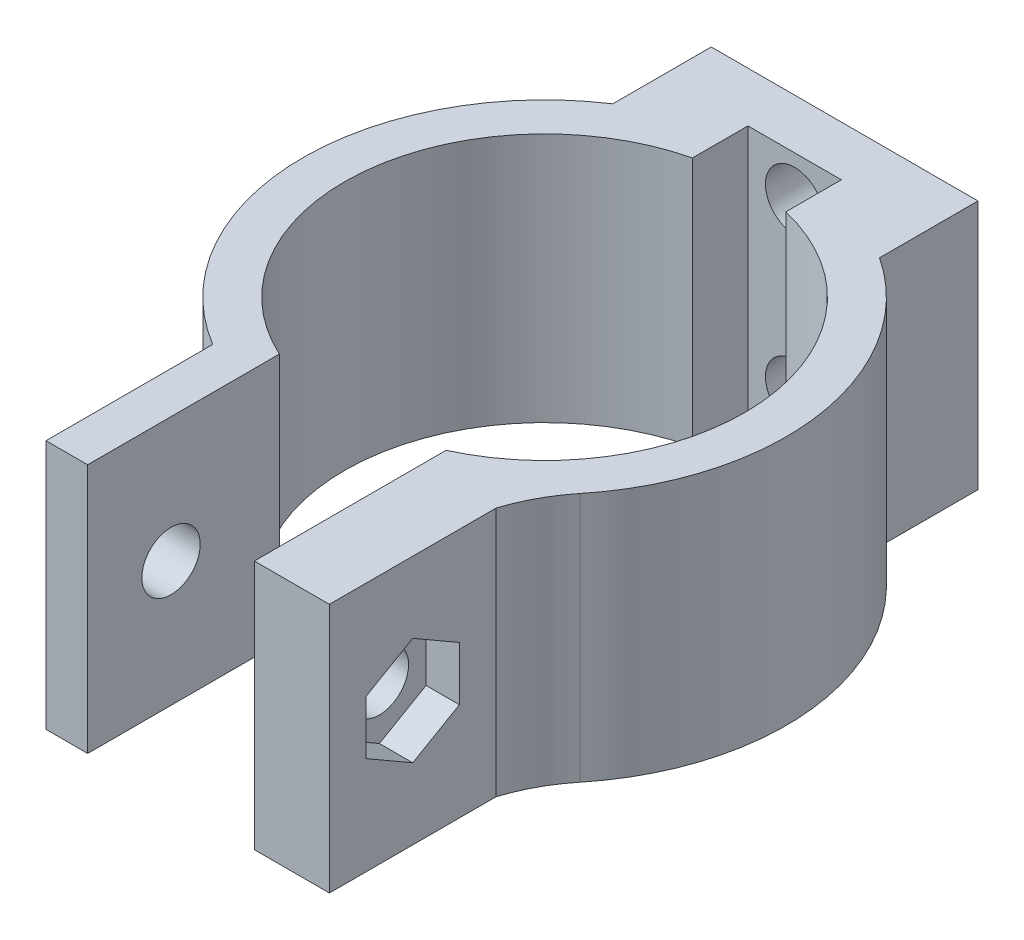
ISO-10303-21;
HEADER;
FILE_DESCRIPTION(('STEP AP214'),'2;1');
FILE_NAME('part.step','',(''),(''),'','','');
FILE_SCHEMA(('AUTOMOTIVE_DESIGN { 1 0 10303 214 1 1 1 1 }'));
ENDSEC;
DATA;
#1=APPLICATION_CONTEXT('core data for automotive mechanical design processes');
#2=APPLICATION_PROTOCOL_DEFINITION('international standard','automotive_design',2000,#1);
#3=PRODUCT_CONTEXT('',#1,'mechanical');
#4=PRODUCT('Part','Part','',(#3));
#5=PRODUCT_RELATED_PRODUCT_CATEGORY('part','',(#4));
#6=PRODUCT_DEFINITION_FORMATION('','',#4);
#7=PRODUCT_DEFINITION_CONTEXT('part definition',#1,'design');
#8=PRODUCT_DEFINITION('design','',#6,#7);
#9=PRODUCT_DEFINITION_SHAPE('','',#8);
#10=(LENGTH_UNIT() NAMED_UNIT(*) SI_UNIT(.MILLI.,.METRE.));
#11=(NAMED_UNIT(*) PLANE_ANGLE_UNIT() SI_UNIT($,.RADIAN.));
#12=(NAMED_UNIT(*) SI_UNIT($,.STERADIAN.) SOLID_ANGLE_UNIT());
#13=UNCERTAINTY_MEASURE_WITH_UNIT(LENGTH_MEASURE(1.E-05),#10,'distance_accuracy_value','');
#14=(GEOMETRIC_REPRESENTATION_CONTEXT(3) GLOBAL_UNCERTAINTY_ASSIGNED_CONTEXT((#13)) GLOBAL_UNIT_ASSIGNED_CONTEXT((#10,
#11,#12)) REPRESENTATION_CONTEXT('',''));
#15=CARTESIAN_POINT('',(0.,0.,0.));
#16=DIRECTION('',(0.,0.,1.));
#17=DIRECTION('',(1.,0.,0.));
#18=AXIS2_PLACEMENT_3D('',#15,#16,#17);
#19=CARTESIAN_POINT('',(0.,15.,-15.));
#20=DIRECTION('',(0.,0.,-1.));
#21=DIRECTION('',(-1.,0.,0.));
#22=AXIS2_PLACEMENT_3D('',#19,#20,#21);
#23=PLANE('',#22);
#24=CARTESIAN_POINT('',(0.,12.5,-15.));
#25=DIRECTION('',(0.,0.,-1.));
#26=DIRECTION('',(-1.,0.,0.));
#27=AXIS2_PLACEMENT_3D('',#24,#25,#26);
#28=CIRCLE('',#27,1.75);
#29=CARTESIAN_POINT('',(-1.75,12.5,-15.));
#30=VERTEX_POINT('',#29);
#31=EDGE_CURVE('E269',#30,#30,#28,.T.);
#32=ORIENTED_EDGE('',*,*,#31,.T.);
#33=EDGE_LOOP('',(#32));
#34=FACE_BOUND('',#33,.T.);
#35=CARTESIAN_POINT('',(0.,2.5,-15.));
#36=DIRECTION('',(0.,0.,-1.));
#37=DIRECTION('',(-1.,0.,0.));
#38=AXIS2_PLACEMENT_3D('',#35,#36,#37);
#39=CIRCLE('',#38,1.75);
#40=CARTESIAN_POINT('',(-1.75,2.5,-15.));
#41=VERTEX_POINT('',#40);
#42=EDGE_CURVE('E265',#41,#41,#39,.T.);
#43=ORIENTED_EDGE('',*,*,#42,.T.);
#44=EDGE_LOOP('',(#43));
#45=FACE_BOUND('',#44,.T.);
#46=DIRECTION('',(1.,0.,0.));
#47=VECTOR('',#46,1.);
#48=CARTESIAN_POINT('',(0.,0.,-15.));
#49=LINE('',#48,#47);
#50=CARTESIAN_POINT('',(-2.8,0.,-15.));
#51=VERTEX_POINT('',#50);
#52=CARTESIAN_POINT('',(2.8,0.,-15.));
#53=VERTEX_POINT('',#52);
#54=EDGE_CURVE('E272',#51,#53,#49,.T.);
#55=ORIENTED_EDGE('',*,*,#54,.T.);
#56=DIRECTION('',(0.,-1.,0.));
#57=VECTOR('',#56,1.);
#58=CARTESIAN_POINT('',(2.8,15.,-15.));
#59=LINE('',#58,#57);
#60=CARTESIAN_POINT('',(2.8,15.,-15.));
#61=VERTEX_POINT('',#60);
#62=EDGE_CURVE('E380',#61,#53,#59,.T.);
#63=ORIENTED_EDGE('',*,*,#62,.F.);
#64=DIRECTION('',(1.,0.,0.));
#65=VECTOR('',#64,1.);
#66=CARTESIAN_POINT('',(0.,15.,-15.));
#67=LINE('',#66,#65);
#68=CARTESIAN_POINT('',(-2.8,15.,-15.));
#69=VERTEX_POINT('',#68);
#70=EDGE_CURVE('E273',#69,#61,#67,.T.);
#71=ORIENTED_EDGE('',*,*,#70,.F.);
#72=DIRECTION('',(0.,-1.,0.));
#73=VECTOR('',#72,1.);
#74=CARTESIAN_POINT('',(-2.8,15.,-15.));
#75=LINE('',#74,#73);
#76=EDGE_CURVE('E312',#69,#51,#75,.T.);
#77=ORIENTED_EDGE('',*,*,#76,.T.);
#78=EDGE_LOOP('',(#55,#63,#71,#77));
#79=FACE_BOUND('',#78,.T.);
#80=ADVANCED_FACE('F32',(#34,#45,#79),#23,.F.);
#81=CARTESIAN_POINT('',(2.8,15.,0.));
#82=DIRECTION('',(-1.,0.,0.));
#83=DIRECTION('',(0.,0.,1.));
#84=AXIS2_PLACEMENT_3D('',#81,#82,#83);
#85=PLANE('',#84);
#86=DIRECTION('',(0.,0.,-1.));
#87=VECTOR('',#86,1.);
#88=CARTESIAN_POINT('',(2.8,0.,0.));
#89=LINE('',#88,#87);
#90=CARTESIAN_POINT('',(2.8,0.,-11.6687617166519));
#91=VERTEX_POINT('',#90);
#92=EDGE_CURVE('E315',#91,#53,#89,.T.);
#93=ORIENTED_EDGE('',*,*,#92,.F.);
#94=DIRECTION('',(0.,-1.,0.));
#95=VECTOR('',#94,1.);
#96=CARTESIAN_POINT('',(2.8,15.,-11.6687617166519));
#97=LINE('',#96,#95);
#98=CARTESIAN_POINT('',(2.8,15.,-11.6687617166519));
#99=VERTEX_POINT('',#98);
#100=EDGE_CURVE('E378',#99,#91,#97,.T.);
#101=ORIENTED_EDGE('',*,*,#100,.F.);
#102=DIRECTION('',(0.,0.,-1.));
#103=VECTOR('',#102,1.);
#104=CARTESIAN_POINT('',(2.8,15.,0.));
#105=LINE('',#104,#103);
#106=EDGE_CURVE('E275',#99,#61,#105,.T.);
#107=ORIENTED_EDGE('',*,*,#106,.T.);
#108=ORIENTED_EDGE('',*,*,#62,.T.);
#109=EDGE_LOOP('',(#93,#101,#107,#108));
#110=FACE_BOUND('',#109,.T.);
#111=ADVANCED_FACE('F447',(#110),#85,.T.);
#112=CARTESIAN_POINT('',(0.,15.,0.));
#113=DIRECTION('',(0.,-1.,0.));
#114=DIRECTION('',(0.,0.,-1.));
#115=AXIS2_PLACEMENT_3D('',#112,#113,#114);
#116=CYLINDRICAL_SURFACE('',#115,12.);
#117=CARTESIAN_POINT('',(0.,0.,0.));
#118=DIRECTION('',(0.,1.,0.));
#119=DIRECTION('',(0.,0.,1.));
#120=AXIS2_PLACEMENT_3D('',#117,#118,#119);
#121=CIRCLE('',#120,12.);
#122=CARTESIAN_POINT('',(5.,0.,10.9087121146357));
#123=VERTEX_POINT('',#122);
#124=EDGE_CURVE('E318',#123,#91,#121,.T.);
#125=ORIENTED_EDGE('',*,*,#124,.F.);
#126=DIRECTION('',(0.,-1.,0.));
#127=VECTOR('',#126,1.);
#128=CARTESIAN_POINT('',(5.,15.,10.9087121146357));
#129=LINE('',#128,#127);
#130=CARTESIAN_POINT('',(5.,15.,10.9087121146357));
#131=VERTEX_POINT('',#130);
#132=EDGE_CURVE('E376',#131,#123,#129,.T.);
#133=ORIENTED_EDGE('',*,*,#132,.F.);
#134=CARTESIAN_POINT('',(0.,15.,0.));
#135=DIRECTION('',(0.,1.,0.));
#136=DIRECTION('',(0.,0.,1.));
#137=AXIS2_PLACEMENT_3D('',#134,#135,#136);
#138=CIRCLE('',#137,12.);
#139=EDGE_CURVE('E279',#131,#99,#138,.T.);
#140=ORIENTED_EDGE('',*,*,#139,.T.);
#141=ORIENTED_EDGE('',*,*,#100,.T.);
#142=EDGE_LOOP('',(#125,#133,#140,#141));
#143=FACE_BOUND('',#142,.T.);
#144=ADVANCED_FACE('F450',(#143),#116,.F.);
#145=CARTESIAN_POINT('',(5.,15.,0.));
#146=DIRECTION('',(1.,0.,0.));
#147=DIRECTION('',(0.,0.,-1.));
#148=AXIS2_PLACEMENT_3D('',#145,#146,#147);
#149=PLANE('',#148);
#150=CARTESIAN_POINT('',(5.00000000000001,7.5,17.4096736459909));
#151=DIRECTION('',(1.,0.,0.));
#152=DIRECTION('',(0.,0.,-1.));
#153=AXIS2_PLACEMENT_3D('',#150,#151,#152);
#154=CIRCLE('',#153,1.75);
#155=CARTESIAN_POINT('',(5.00000000000001,7.5,15.6596736459909));
#156=VERTEX_POINT('',#155);
#157=EDGE_CURVE('E261',#156,#156,#154,.T.);
#158=ORIENTED_EDGE('',*,*,#157,.T.);
#159=EDGE_LOOP('',(#158));
#160=FACE_BOUND('',#159,.T.);
#161=DIRECTION('',(0.,0.,1.));
#162=VECTOR('',#161,1.);
#163=CARTESIAN_POINT('',(5.,0.,0.));
#164=LINE('',#163,#162);
#165=CARTESIAN_POINT('',(5.00000000000001,0.,22.4096736459909));
#166=VERTEX_POINT('',#165);
#167=EDGE_CURVE('E321',#123,#166,#164,.T.);
#168=ORIENTED_EDGE('',*,*,#167,.T.);
#169=DIRECTION('',(0.,-1.,0.));
#170=VECTOR('',#169,1.);
#171=CARTESIAN_POINT('',(5.00000000000001,15.,22.4096736459909));
#172=LINE('',#171,#170);
#173=CARTESIAN_POINT('',(5.00000000000001,15.,22.4096736459909));
#174=VERTEX_POINT('',#173);
#175=EDGE_CURVE('E373',#174,#166,#172,.T.);
#176=ORIENTED_EDGE('',*,*,#175,.F.);
#177=DIRECTION('',(0.,0.,1.));
#178=VECTOR('',#177,1.);
#179=CARTESIAN_POINT('',(5.,15.,0.));
#180=LINE('',#179,#178);
#181=EDGE_CURVE('E282',#131,#174,#180,.T.);
#182=ORIENTED_EDGE('',*,*,#181,.F.);
#183=ORIENTED_EDGE('',*,*,#132,.T.);
#184=EDGE_LOOP('',(#168,#176,#182,#183));
#185=FACE_BOUND('',#184,.T.);
#186=ADVANCED_FACE('F455',(#160,#185),#149,.F.);
#187=CARTESIAN_POINT('',(0.,15.,22.4096736459909));
#188=DIRECTION('',(0.,0.,-1.));
#189=DIRECTION('',(-1.,0.,0.));
#190=AXIS2_PLACEMENT_3D('',#187,#188,#189);
#191=PLANE('',#190);
#192=DIRECTION('',(1.,0.,0.));
#193=VECTOR('',#192,1.);
#194=CARTESIAN_POINT('',(0.,0.,22.4096736459909));
#195=LINE('',#194,#193);
#196=CARTESIAN_POINT('',(9.50000000000001,0.,22.4096736459909));
#197=VERTEX_POINT('',#196);
#198=EDGE_CURVE('E323',#166,#197,#195,.T.);
#199=ORIENTED_EDGE('',*,*,#198,.T.);
#200=DIRECTION('',(0.,-1.,0.));
#201=VECTOR('',#200,1.);
#202=CARTESIAN_POINT('',(9.50000000000001,15.,22.4096736459909));
#203=LINE('',#202,#201);
#204=CARTESIAN_POINT('',(9.50000000000001,15.,22.4096736459909));
#205=VERTEX_POINT('',#204);
#206=EDGE_CURVE('E205',#205,#197,#203,.T.);
#207=ORIENTED_EDGE('',*,*,#206,.F.);
#208=DIRECTION('',(1.,0.,0.));
#209=VECTOR('',#208,1.);
#210=CARTESIAN_POINT('',(0.,15.,22.4096736459909));
#211=LINE('',#210,#209);
#212=EDGE_CURVE('E284',#174,#205,#211,.T.);
#213=ORIENTED_EDGE('',*,*,#212,.F.);
#214=ORIENTED_EDGE('',*,*,#175,.T.);
#215=EDGE_LOOP('',(#199,#207,#213,#214));
#216=FACE_BOUND('',#215,.T.);
#217=ADVANCED_FACE('F458',(#216),#191,.F.);
#218=CARTESIAN_POINT('',(7.50000000000001,15.,0.));
#219=DIRECTION('',(-1.,0.,0.));
#220=DIRECTION('',(0.,0.,1.));
#221=AXIS2_PLACEMENT_3D('',#218,#219,#220);
#222=PLANE('',#221);
#223=DIRECTION('',(0.,1.,0.));
#224=VECTOR('',#223,1.);
#225=CARTESIAN_POINT('',(7.50000000000001,5.88341924626905,14.6096736459909));
#226=LINE('',#225,#224);
#227=CARTESIAN_POINT('',(7.50000000000001,5.88341924626905,14.6096736459909));
#228=VERTEX_POINT('',#227);
#229=CARTESIAN_POINT('',(7.50000000000001,9.11658075373096,14.6096736459909));
#230=VERTEX_POINT('',#229);
#231=EDGE_CURVE('E198',#228,#230,#226,.T.);
#232=ORIENTED_EDGE('',*,*,#231,.T.);
#233=DIRECTION('',(0.,0.5,0.866025403784439));
#234=VECTOR('',#233,1.);
#235=CARTESIAN_POINT('',(7.50000000000001,9.11658075373096,14.6096736459909));
#236=LINE('',#235,#234);
#237=CARTESIAN_POINT('',(7.50000000000001,10.7331615074619,17.4096736459909));
#238=VERTEX_POINT('',#237);
#239=EDGE_CURVE('E222',#230,#238,#236,.T.);
#240=ORIENTED_EDGE('',*,*,#239,.T.);
#241=DIRECTION('',(0.,-0.5,0.866025403784438));
#242=VECTOR('',#241,1.);
#243=CARTESIAN_POINT('',(7.50000000000001,10.7331615074619,17.4096736459909));
#244=LINE('',#243,#242);
#245=CARTESIAN_POINT('',(7.50000000000001,9.11658075373096,20.2096736459909));
#246=VERTEX_POINT('',#245);
#247=EDGE_CURVE('E204',#238,#246,#244,.T.);
#248=ORIENTED_EDGE('',*,*,#247,.T.);
#249=DIRECTION('',(0.,-1.,0.));
#250=VECTOR('',#249,1.);
#251=CARTESIAN_POINT('',(7.50000000000001,9.11658075373096,20.2096736459909));
#252=LINE('',#251,#250);
#253=CARTESIAN_POINT('',(7.50000000000001,5.88341924626906,20.2096736459909));
#254=VERTEX_POINT('',#253);
#255=EDGE_CURVE('E225',#246,#254,#252,.T.);
#256=ORIENTED_EDGE('',*,*,#255,.T.);
#257=DIRECTION('',(0.,-0.5,-0.866025403784439));
#258=VECTOR('',#257,1.);
#259=CARTESIAN_POINT('',(7.50000000000001,5.88341924626906,20.2096736459909));
#260=LINE('',#259,#258);
#261=CARTESIAN_POINT('',(7.50000000000001,4.26683849253811,17.4096736459909));
#262=VERTEX_POINT('',#261);
#263=EDGE_CURVE('E228',#254,#262,#260,.T.);
#264=ORIENTED_EDGE('',*,*,#263,.T.);
#265=DIRECTION('',(0.,0.5,-0.866025403784439));
#266=VECTOR('',#265,1.);
#267=CARTESIAN_POINT('',(7.50000000000001,4.26683849253811,17.4096736459909));
#268=LINE('',#267,#266);
#269=EDGE_CURVE('E231',#262,#228,#268,.T.);
#270=ORIENTED_EDGE('',*,*,#269,.T.);
#271=EDGE_LOOP('',(#232,#240,#248,#256,#264,#270));
#272=FACE_BOUND('',#271,.T.);
#273=CARTESIAN_POINT('',(7.50000000000001,7.5,17.4096736459909));
#274=DIRECTION('',(1.,0.,0.));
#275=DIRECTION('',(0.,0.,-1.));
#276=AXIS2_PLACEMENT_3D('',#273,#274,#275);
#277=CIRCLE('',#276,1.75);
#278=CARTESIAN_POINT('',(7.50000000000001,7.5,15.6596736459909));
#279=VERTEX_POINT('',#278);
#280=EDGE_CURVE('E254',#279,#279,#277,.T.);
#281=ORIENTED_EDGE('',*,*,#280,.F.);
#282=EDGE_LOOP('',(#281));
#283=FACE_BOUND('',#282,.T.);
#284=ADVANCED_FACE('F460',(#272,#283),#222,.F.);
#285=CARTESIAN_POINT('',(0.,15.,0.));
#286=DIRECTION('',(0.,-1.,0.));
#287=DIRECTION('',(0.,0.,-1.));
#288=AXIS2_PLACEMENT_3D('',#285,#286,#287);
#289=CYLINDRICAL_SURFACE('',#288,14.5);
#290=CARTESIAN_POINT('',(0.,15.,0.));
#291=DIRECTION('',(0.,1.,0.));
#292=DIRECTION('',(0.,0.,1.));
#293=AXIS2_PLACEMENT_3D('',#290,#291,#292);
#294=CIRCLE('',#293,14.5);
#295=CARTESIAN_POINT('',(11.2653016759038,15.,9.12923754488181));
#296=VERTEX_POINT('',#295);
#297=CARTESIAN_POINT('',(8.,15.,-12.0933866224478));
#298=VERTEX_POINT('',#297);
#299=EDGE_CURVE('E286',#296,#298,#294,.T.);
#300=ORIENTED_EDGE('',*,*,#299,.F.);
#301=DIRECTION('',(0.,-1.,0.));
#302=VECTOR('',#301,1.);
#303=CARTESIAN_POINT('',(11.2653016759038,15.,9.12923754488181));
#304=LINE('',#303,#302);
#305=CARTESIAN_POINT('',(11.2653016759038,0.,9.12923754488181));
#306=VERTEX_POINT('',#305);
#307=EDGE_CURVE('E382',#296,#306,#304,.T.);
#308=ORIENTED_EDGE('',*,*,#307,.T.);
#309=CARTESIAN_POINT('',(0.,0.,0.));
#310=DIRECTION('',(0.,1.,0.));
#311=DIRECTION('',(0.,0.,1.));
#312=AXIS2_PLACEMENT_3D('',#309,#310,#311);
#313=CIRCLE('',#312,14.5);
#314=CARTESIAN_POINT('',(8.,0.,-12.0933866224478));
#315=VERTEX_POINT('',#314);
#316=EDGE_CURVE('E325',#306,#315,#313,.T.);
#317=ORIENTED_EDGE('',*,*,#316,.T.);
#318=DIRECTION('',(0.,-1.,0.));
#319=VECTOR('',#318,1.);
#320=CARTESIAN_POINT('',(8.,15.,-12.0933866224478));
#321=LINE('',#320,#319);
#322=EDGE_CURVE('E370',#298,#315,#321,.T.);
#323=ORIENTED_EDGE('',*,*,#322,.F.);
#324=EDGE_LOOP('',(#300,#308,#317,#323));
#325=FACE_BOUND('',#324,.T.);
#326=ADVANCED_FACE('F399',(#325),#289,.T.);
#327=CARTESIAN_POINT('',(8.00000000000001,15.,0.));
#328=DIRECTION('',(-1.,0.,0.));
#329=DIRECTION('',(0.,0.,1.));
#330=AXIS2_PLACEMENT_3D('',#327,#328,#329);
#331=PLANE('',#330);
#332=DIRECTION('',(0.,0.,-1.));
#333=VECTOR('',#332,1.);
#334=CARTESIAN_POINT('',(8.00000000000001,0.,0.));
#335=LINE('',#334,#333);
#336=CARTESIAN_POINT('',(8.,0.,-18.));
#337=VERTEX_POINT('',#336);
#338=EDGE_CURVE('E327',#315,#337,#335,.T.);
#339=ORIENTED_EDGE('',*,*,#338,.T.);
#340=DIRECTION('',(0.,-1.,0.));
#341=VECTOR('',#340,1.);
#342=CARTESIAN_POINT('',(8.,15.,-18.));
#343=LINE('',#342,#341);
#344=CARTESIAN_POINT('',(8.,15.,-18.));
#345=VERTEX_POINT('',#344);
#346=EDGE_CURVE('E367',#345,#337,#343,.T.);
#347=ORIENTED_EDGE('',*,*,#346,.F.);
#348=DIRECTION('',(0.,0.,-1.));
#349=VECTOR('',#348,1.);
#350=CARTESIAN_POINT('',(8.00000000000001,15.,0.));
#351=LINE('',#350,#349);
#352=EDGE_CURVE('E288',#298,#345,#351,.T.);
#353=ORIENTED_EDGE('',*,*,#352,.F.);
#354=ORIENTED_EDGE('',*,*,#322,.T.);
#355=EDGE_LOOP('',(#339,#347,#353,#354));
#356=FACE_BOUND('',#355,.T.);
#357=ADVANCED_FACE('F408',(#356),#331,.F.);
#358=CARTESIAN_POINT('',(0.,15.,-18.));
#359=DIRECTION('',(0.,0.,1.));
#360=DIRECTION('',(1.,0.,0.));
#361=AXIS2_PLACEMENT_3D('',#358,#359,#360);
#362=PLANE('',#361);
#363=CARTESIAN_POINT('',(0.,12.5,-18.));
#364=DIRECTION('',(0.,0.,1.));
#365=DIRECTION('',(1.,0.,0.));
#366=AXIS2_PLACEMENT_3D('',#363,#364,#365);
#367=CIRCLE('',#366,1.75);
#368=CARTESIAN_POINT('',(1.75,12.5,-18.));
#369=VERTEX_POINT('',#368);
#370=EDGE_CURVE('E268',#369,#369,#367,.T.);
#371=ORIENTED_EDGE('',*,*,#370,.T.);
#372=EDGE_LOOP('',(#371));
#373=FACE_BOUND('',#372,.T.);
#374=CARTESIAN_POINT('',(0.,2.5,-18.));
#375=DIRECTION('',(0.,0.,1.));
#376=DIRECTION('',(1.,0.,0.));
#377=AXIS2_PLACEMENT_3D('',#374,#375,#376);
#378=CIRCLE('',#377,1.75);
#379=CARTESIAN_POINT('',(1.75,2.5,-18.));
#380=VERTEX_POINT('',#379);
#381=EDGE_CURVE('E264',#380,#380,#378,.T.);
#382=ORIENTED_EDGE('',*,*,#381,.T.);
#383=EDGE_LOOP('',(#382));
#384=FACE_BOUND('',#383,.T.);
#385=DIRECTION('',(-1.,0.,0.));
#386=VECTOR('',#385,1.);
#387=CARTESIAN_POINT('',(0.,0.,-18.));
#388=LINE('',#387,#386);
#389=CARTESIAN_POINT('',(-8.,0.,-18.));
#390=VERTEX_POINT('',#389);
#391=EDGE_CURVE('E329',#337,#390,#388,.T.);
#392=ORIENTED_EDGE('',*,*,#391,.T.);
#393=DIRECTION('',(0.,-1.,0.));
#394=VECTOR('',#393,1.);
#395=CARTESIAN_POINT('',(-8.,15.,-18.));
#396=LINE('',#395,#394);
#397=CARTESIAN_POINT('',(-8.,15.,-18.));
#398=VERTEX_POINT('',#397);
#399=EDGE_CURVE('E365',#398,#390,#396,.T.);
#400=ORIENTED_EDGE('',*,*,#399,.F.);
#401=DIRECTION('',(-1.,0.,0.));
#402=VECTOR('',#401,1.);
#403=CARTESIAN_POINT('',(0.,15.,-18.));
#404=LINE('',#403,#402);
#405=EDGE_CURVE('E290',#345,#398,#404,.T.);
#406=ORIENTED_EDGE('',*,*,#405,.F.);
#407=ORIENTED_EDGE('',*,*,#346,.T.);
#408=EDGE_LOOP('',(#392,#400,#406,#407));
#409=FACE_BOUND('',#408,.T.);
#410=ADVANCED_FACE('F411',(#373,#384,#409),#362,.F.);
#411=CARTESIAN_POINT('',(-7.99999999999999,15.,0.));
#412=DIRECTION('',(-1.,0.,0.));
#413=DIRECTION('',(0.,0.,1.));
#414=AXIS2_PLACEMENT_3D('',#411,#412,#413);
#415=PLANE('',#414);
#416=DIRECTION('',(0.,0.,-1.));
#417=VECTOR('',#416,1.);
#418=CARTESIAN_POINT('',(-7.99999999999999,0.,0.));
#419=LINE('',#418,#417);
#420=CARTESIAN_POINT('',(-8.,0.,-12.0933866224478));
#421=VERTEX_POINT('',#420);
#422=EDGE_CURVE('E332',#421,#390,#419,.T.);
#423=ORIENTED_EDGE('',*,*,#422,.F.);
#424=DIRECTION('',(0.,-1.,0.));
#425=VECTOR('',#424,1.);
#426=CARTESIAN_POINT('',(-8.,15.,-12.0933866224478));
#427=LINE('',#426,#425);
#428=CARTESIAN_POINT('',(-8.,15.,-12.0933866224478));
#429=VERTEX_POINT('',#428);
#430=EDGE_CURVE('E363',#429,#421,#427,.T.);
#431=ORIENTED_EDGE('',*,*,#430,.F.);
#432=DIRECTION('',(0.,0.,-1.));
#433=VECTOR('',#432,1.);
#434=CARTESIAN_POINT('',(-7.99999999999999,15.,0.));
#435=LINE('',#434,#433);
#436=EDGE_CURVE('E292',#429,#398,#435,.T.);
#437=ORIENTED_EDGE('',*,*,#436,.T.);
#438=ORIENTED_EDGE('',*,*,#399,.T.);
#439=EDGE_LOOP('',(#423,#431,#437,#438));
#440=FACE_BOUND('',#439,.T.);
#441=ADVANCED_FACE('F414',(#440),#415,.T.);
#442=CARTESIAN_POINT('',(0.,15.,0.));
#443=DIRECTION('',(0.,-1.,0.));
#444=DIRECTION('',(0.,0.,-1.));
#445=AXIS2_PLACEMENT_3D('',#442,#443,#444);
#446=CYLINDRICAL_SURFACE('',#445,14.5);
#447=CARTESIAN_POINT('',(0.,0.,0.));
#448=DIRECTION('',(0.,1.,0.));
#449=DIRECTION('',(0.,0.,1.));
#450=AXIS2_PLACEMENT_3D('',#447,#448,#449);
#451=CIRCLE('',#450,14.5);
#452=CARTESIAN_POINT('',(-7.5,0.,12.4096736459909));
#453=VERTEX_POINT('',#452);
#454=EDGE_CURVE('E335',#453,#421,#451,.F.);
#455=ORIENTED_EDGE('',*,*,#454,.F.);
#456=DIRECTION('',(0.,-1.,0.));
#457=VECTOR('',#456,1.);
#458=CARTESIAN_POINT('',(-7.5,15.,12.4096736459909));
#459=LINE('',#458,#457);
#460=CARTESIAN_POINT('',(-7.5,15.,12.4096736459909));
#461=VERTEX_POINT('',#460);
#462=EDGE_CURVE('E361',#461,#453,#459,.T.);
#463=ORIENTED_EDGE('',*,*,#462,.F.);
#464=CARTESIAN_POINT('',(0.,15.,0.));
#465=DIRECTION('',(0.,1.,0.));
#466=DIRECTION('',(0.,0.,1.));
#467=AXIS2_PLACEMENT_3D('',#464,#465,#466);
#468=CIRCLE('',#467,14.5);
#469=EDGE_CURVE('E295',#461,#429,#468,.F.);
#470=ORIENTED_EDGE('',*,*,#469,.T.);
#471=ORIENTED_EDGE('',*,*,#430,.T.);
#472=EDGE_LOOP('',(#455,#463,#470,#471));
#473=FACE_BOUND('',#472,.T.);
#474=ADVANCED_FACE('F419',(#473),#446,.T.);
#475=CARTESIAN_POINT('',(-7.5,15.,0.));
#476=DIRECTION('',(-1.,0.,0.));
#477=DIRECTION('',(0.,0.,1.));
#478=AXIS2_PLACEMENT_3D('',#475,#476,#477);
#479=PLANE('',#478);
#480=CARTESIAN_POINT('',(-7.5,7.5,17.4096736459909));
#481=DIRECTION('',(-1.,0.,0.));
#482=DIRECTION('',(0.,0.,1.));
#483=AXIS2_PLACEMENT_3D('',#480,#481,#482);
#484=CIRCLE('',#483,1.75);
#485=CARTESIAN_POINT('',(-7.5,7.5,19.1596736459909));
#486=VERTEX_POINT('',#485);
#487=EDGE_CURVE('E258',#486,#486,#484,.T.);
#488=ORIENTED_EDGE('',*,*,#487,.F.);
#489=EDGE_LOOP('',(#488));
#490=FACE_BOUND('',#489,.T.);
#491=DIRECTION('',(0.,0.,-1.));
#492=VECTOR('',#491,1.);
#493=CARTESIAN_POINT('',(-7.5,0.,0.));
#494=LINE('',#493,#492);
#495=CARTESIAN_POINT('',(-7.5,0.,22.4096736459909));
#496=VERTEX_POINT('',#495);
#497=EDGE_CURVE('E338',#496,#453,#494,.T.);
#498=ORIENTED_EDGE('',*,*,#497,.F.);
#499=DIRECTION('',(0.,-1.,0.));
#500=VECTOR('',#499,1.);
#501=CARTESIAN_POINT('',(-7.5,15.,22.4096736459909));
#502=LINE('',#501,#500);
#503=CARTESIAN_POINT('',(-7.5,15.,22.4096736459909));
#504=VERTEX_POINT('',#503);
#505=EDGE_CURVE('E359',#504,#496,#502,.T.);
#506=ORIENTED_EDGE('',*,*,#505,.F.);
#507=DIRECTION('',(0.,0.,-1.));
#508=VECTOR('',#507,1.);
#509=CARTESIAN_POINT('',(-7.5,15.,0.));
#510=LINE('',#509,#508);
#511=EDGE_CURVE('E298',#504,#461,#510,.T.);
#512=ORIENTED_EDGE('',*,*,#511,.T.);
#513=ORIENTED_EDGE('',*,*,#462,.T.);
#514=EDGE_LOOP('',(#498,#506,#512,#513));
#515=FACE_BOUND('',#514,.T.);
#516=ADVANCED_FACE('F422',(#490,#515),#479,.T.);
#517=CARTESIAN_POINT('',(0.,15.,22.4096736459909));
#518=DIRECTION('',(0.,0.,1.));
#519=DIRECTION('',(1.,0.,0.));
#520=AXIS2_PLACEMENT_3D('',#517,#518,#519);
#521=PLANE('',#520);
#522=DIRECTION('',(-1.,0.,0.));
#523=VECTOR('',#522,1.);
#524=CARTESIAN_POINT('',(0.,0.,22.4096736459909));
#525=LINE('',#524,#523);
#526=CARTESIAN_POINT('',(-5.,0.,22.4096736459909));
#527=VERTEX_POINT('',#526);
#528=EDGE_CURVE('E341',#527,#496,#525,.T.);
#529=ORIENTED_EDGE('',*,*,#528,.F.);
#530=DIRECTION('',(0.,-1.,0.));
#531=VECTOR('',#530,1.);
#532=CARTESIAN_POINT('',(-5.,15.,22.4096736459909));
#533=LINE('',#532,#531);
#534=CARTESIAN_POINT('',(-5.,15.,22.4096736459909));
#535=VERTEX_POINT('',#534);
#536=EDGE_CURVE('E357',#535,#527,#533,.T.);
#537=ORIENTED_EDGE('',*,*,#536,.F.);
#538=DIRECTION('',(-1.,0.,0.));
#539=VECTOR('',#538,1.);
#540=CARTESIAN_POINT('',(0.,15.,22.4096736459909));
#541=LINE('',#540,#539);
#542=EDGE_CURVE('E301',#535,#504,#541,.T.);
#543=ORIENTED_EDGE('',*,*,#542,.T.);
#544=ORIENTED_EDGE('',*,*,#505,.T.);
#545=EDGE_LOOP('',(#529,#537,#543,#544));
#546=FACE_BOUND('',#545,.T.);
#547=ADVANCED_FACE('F427',(#546),#521,.T.);
#548=CARTESIAN_POINT('',(-5.,15.,0.));
#549=DIRECTION('',(1.,0.,0.));
#550=DIRECTION('',(0.,0.,-1.));
#551=AXIS2_PLACEMENT_3D('',#548,#549,#550);
#552=PLANE('',#551);
#553=CARTESIAN_POINT('',(-5.,7.5,17.4096736459909));
#554=DIRECTION('',(1.,0.,0.));
#555=DIRECTION('',(0.,0.,-1.));
#556=AXIS2_PLACEMENT_3D('',#553,#554,#555);
#557=CIRCLE('',#556,1.75);
#558=CARTESIAN_POINT('',(-5.,7.5,15.6596736459909));
#559=VERTEX_POINT('',#558);
#560=EDGE_CURVE('E257',#559,#559,#557,.T.);
#561=ORIENTED_EDGE('',*,*,#560,.F.);
#562=EDGE_LOOP('',(#561));
#563=FACE_BOUND('',#562,.T.);
#564=DIRECTION('',(0.,0.,1.));
#565=VECTOR('',#564,1.);
#566=CARTESIAN_POINT('',(-5.,0.,0.));
#567=LINE('',#566,#565);
#568=CARTESIAN_POINT('',(-5.,0.,10.9087121146357));
#569=VERTEX_POINT('',#568);
#570=EDGE_CURVE('E344',#569,#527,#567,.T.);
#571=ORIENTED_EDGE('',*,*,#570,.F.);
#572=DIRECTION('',(0.,-1.,0.));
#573=VECTOR('',#572,1.);
#574=CARTESIAN_POINT('',(-5.,15.,10.9087121146357));
#575=LINE('',#574,#573);
#576=CARTESIAN_POINT('',(-5.,15.,10.9087121146357));
#577=VERTEX_POINT('',#576);
#578=EDGE_CURVE('E355',#577,#569,#575,.T.);
#579=ORIENTED_EDGE('',*,*,#578,.F.);
#580=DIRECTION('',(0.,0.,1.));
#581=VECTOR('',#580,1.);
#582=CARTESIAN_POINT('',(-5.,15.,0.));
#583=LINE('',#582,#581);
#584=EDGE_CURVE('E304',#577,#535,#583,.T.);
#585=ORIENTED_EDGE('',*,*,#584,.T.);
#586=ORIENTED_EDGE('',*,*,#536,.T.);
#587=EDGE_LOOP('',(#571,#579,#585,#586));
#588=FACE_BOUND('',#587,.T.);
#589=ADVANCED_FACE('F430',(#563,#588),#552,.T.);
#590=CARTESIAN_POINT('',(0.,15.,0.));
#591=DIRECTION('',(0.,-1.,0.));
#592=DIRECTION('',(0.,0.,-1.));
#593=AXIS2_PLACEMENT_3D('',#590,#591,#592);
#594=CYLINDRICAL_SURFACE('',#593,12.);
#595=CARTESIAN_POINT('',(0.,0.,0.));
#596=DIRECTION('',(0.,1.,0.));
#597=DIRECTION('',(0.,0.,1.));
#598=AXIS2_PLACEMENT_3D('',#595,#596,#597);
#599=CIRCLE('',#598,12.);
#600=CARTESIAN_POINT('',(-2.8,0.,-11.6687617166519));
#601=VERTEX_POINT('',#600);
#602=EDGE_CURVE('E347',#601,#569,#599,.T.);
#603=ORIENTED_EDGE('',*,*,#602,.F.);
#604=DIRECTION('',(0.,-1.,0.));
#605=VECTOR('',#604,1.);
#606=CARTESIAN_POINT('',(-2.8,15.,-11.6687617166519));
#607=LINE('',#606,#605);
#608=CARTESIAN_POINT('',(-2.8,15.,-11.6687617166519));
#609=VERTEX_POINT('',#608);
#610=EDGE_CURVE('E353',#609,#601,#607,.T.);
#611=ORIENTED_EDGE('',*,*,#610,.F.);
#612=CARTESIAN_POINT('',(0.,15.,0.));
#613=DIRECTION('',(0.,1.,0.));
#614=DIRECTION('',(0.,0.,1.));
#615=AXIS2_PLACEMENT_3D('',#612,#613,#614);
#616=CIRCLE('',#615,12.);
#617=EDGE_CURVE('E307',#609,#577,#616,.T.);
#618=ORIENTED_EDGE('',*,*,#617,.T.);
#619=ORIENTED_EDGE('',*,*,#578,.T.);
#620=EDGE_LOOP('',(#603,#611,#618,#619));
#621=FACE_BOUND('',#620,.T.);
#622=ADVANCED_FACE('F434',(#621),#594,.F.);
#623=CARTESIAN_POINT('',(-2.8,15.,0.));
#624=DIRECTION('',(-1.,0.,0.));
#625=DIRECTION('',(0.,0.,1.));
#626=AXIS2_PLACEMENT_3D('',#623,#624,#625);
#627=PLANE('',#626);
#628=DIRECTION('',(0.,0.,-1.));
#629=VECTOR('',#628,1.);
#630=CARTESIAN_POINT('',(-2.8,0.,0.));
#631=LINE('',#630,#629);
#632=EDGE_CURVE('E276',#601,#51,#631,.T.);
#633=ORIENTED_EDGE('',*,*,#632,.T.);
#634=ORIENTED_EDGE('',*,*,#76,.F.);
#635=DIRECTION('',(0.,0.,-1.));
#636=VECTOR('',#635,1.);
#637=CARTESIAN_POINT('',(-2.8,15.,0.));
#638=LINE('',#637,#636);
#639=EDGE_CURVE('E310',#609,#69,#638,.T.);
#640=ORIENTED_EDGE('',*,*,#639,.F.);
#641=ORIENTED_EDGE('',*,*,#610,.T.);
#642=EDGE_LOOP('',(#633,#634,#640,#641));
#643=FACE_BOUND('',#642,.T.);
#644=ADVANCED_FACE('F439',(#643),#627,.F.);
#645=CARTESIAN_POINT('',(0.,15.,0.));
#646=DIRECTION('',(0.,1.,0.));
#647=DIRECTION('',(0.,0.,1.));
#648=AXIS2_PLACEMENT_3D('',#645,#646,#647);
#649=PLANE('',#648);
#650=ORIENTED_EDGE('',*,*,#70,.T.);
#651=ORIENTED_EDGE('',*,*,#106,.F.);
#652=ORIENTED_EDGE('',*,*,#139,.F.);
#653=ORIENTED_EDGE('',*,*,#181,.T.);
#654=ORIENTED_EDGE('',*,*,#212,.T.);
#655=DIRECTION('',(0.,0.,1.));
#656=VECTOR('',#655,1.);
#657=CARTESIAN_POINT('',(9.50000000000001,15.,12.4096736459909));
#658=LINE('',#657,#656);
#659=CARTESIAN_POINT('',(9.50000000000001,15.,12.4096736459909));
#660=VERTEX_POINT('',#659);
#661=EDGE_CURVE('E251',#660,#205,#658,.T.);
#662=ORIENTED_EDGE('',*,*,#661,.F.);
#663=CARTESIAN_POINT('',(19.0344752454926,15.,15.4252634379037));
#664=DIRECTION('',(0.,1.,0.));
#665=DIRECTION('',(0.,0.,1.));
#666=AXIS2_PLACEMENT_3D('',#663,#664,#665);
#667=CIRCLE('',#666,10.);
#668=EDGE_CURVE('E11',#660,#296,#667,.F.);
#669=ORIENTED_EDGE('',*,*,#668,.T.);
#670=ORIENTED_EDGE('',*,*,#299,.T.);
#671=ORIENTED_EDGE('',*,*,#352,.T.);
#672=ORIENTED_EDGE('',*,*,#405,.T.);
#673=ORIENTED_EDGE('',*,*,#436,.F.);
#674=ORIENTED_EDGE('',*,*,#469,.F.);
#675=ORIENTED_EDGE('',*,*,#511,.F.);
#676=ORIENTED_EDGE('',*,*,#542,.F.);
#677=ORIENTED_EDGE('',*,*,#584,.F.);
#678=ORIENTED_EDGE('',*,*,#617,.F.);
#679=ORIENTED_EDGE('',*,*,#639,.T.);
#680=EDGE_LOOP('',(#650,#651,#652,#653,#654,#662,#669,#670,#671,#672,#673,#674,#675,#676,#677,
#678,#679));
#681=FACE_BOUND('',#680,.T.);
#682=ADVANCED_FACE('F402',(#681),#649,.T.);
#683=CARTESIAN_POINT('',(0.,0.,0.));
#684=DIRECTION('',(0.,1.,0.));
#685=DIRECTION('',(0.,0.,1.));
#686=AXIS2_PLACEMENT_3D('',#683,#684,#685);
#687=PLANE('',#686);
#688=ORIENTED_EDGE('',*,*,#54,.F.);
#689=ORIENTED_EDGE('',*,*,#632,.F.);
#690=ORIENTED_EDGE('',*,*,#602,.T.);
#691=ORIENTED_EDGE('',*,*,#570,.T.);
#692=ORIENTED_EDGE('',*,*,#528,.T.);
#693=ORIENTED_EDGE('',*,*,#497,.T.);
#694=ORIENTED_EDGE('',*,*,#454,.T.);
#695=ORIENTED_EDGE('',*,*,#422,.T.);
#696=ORIENTED_EDGE('',*,*,#391,.F.);
#697=ORIENTED_EDGE('',*,*,#338,.F.);
#698=ORIENTED_EDGE('',*,*,#316,.F.);
#699=CARTESIAN_POINT('',(19.0344752454926,0.,15.4252634379037));
#700=DIRECTION('',(0.,1.,0.));
#701=DIRECTION('',(0.,0.,1.));
#702=AXIS2_PLACEMENT_3D('',#699,#700,#701);
#703=CIRCLE('',#702,10.);
#704=CARTESIAN_POINT('',(9.50000000000001,0.,12.4096736459909));
#705=VERTEX_POINT('',#704);
#706=EDGE_CURVE('E40',#306,#705,#703,.T.);
#707=ORIENTED_EDGE('',*,*,#706,.T.);
#708=DIRECTION('',(0.,0.,-1.));
#709=VECTOR('',#708,1.);
#710=CARTESIAN_POINT('',(9.50000000000001,0.,22.4096736459909));
#711=LINE('',#710,#709);
#712=EDGE_CURVE('E246',#197,#705,#711,.T.);
#713=ORIENTED_EDGE('',*,*,#712,.F.);
#714=ORIENTED_EDGE('',*,*,#198,.F.);
#715=ORIENTED_EDGE('',*,*,#167,.F.);
#716=ORIENTED_EDGE('',*,*,#124,.T.);
#717=ORIENTED_EDGE('',*,*,#92,.T.);
#718=EDGE_LOOP('',(#688,#689,#690,#691,#692,#693,#694,#695,#696,#697,#698,#707,#713,#714,#715,
#716,#717));
#719=FACE_BOUND('',#718,.T.);
#720=ADVANCED_FACE('F393',(#719),#687,.F.);
#721=CARTESIAN_POINT('',(0.,2.5,22.4096736459909));
#722=DIRECTION('',(0.,0.,-1.));
#723=DIRECTION('',(-1.,0.,0.));
#724=AXIS2_PLACEMENT_3D('',#721,#722,#723);
#725=CYLINDRICAL_SURFACE('',#724,1.75);
#726=ORIENTED_EDGE('',*,*,#381,.F.);
#727=EDGE_LOOP('',(#726));
#728=FACE_BOUND('',#727,.T.);
#729=ORIENTED_EDGE('',*,*,#42,.F.);
#730=EDGE_LOOP('',(#729));
#731=FACE_BOUND('',#730,.T.);
#732=ADVANCED_FACE('F637',(#728,#731),#725,.F.);
#733=CARTESIAN_POINT('',(0.,12.5,22.4096736459909));
#734=DIRECTION('',(0.,0.,-1.));
#735=DIRECTION('',(-1.,0.,0.));
#736=AXIS2_PLACEMENT_3D('',#733,#734,#735);
#737=CYLINDRICAL_SURFACE('',#736,1.75);
#738=ORIENTED_EDGE('',*,*,#370,.F.);
#739=EDGE_LOOP('',(#738));
#740=FACE_BOUND('',#739,.T.);
#741=ORIENTED_EDGE('',*,*,#31,.F.);
#742=EDGE_LOOP('',(#741));
#743=FACE_BOUND('',#742,.T.);
#744=ADVANCED_FACE('F495',(#740,#743),#737,.F.);
#745=CARTESIAN_POINT('',(-14.5,7.5,17.4096736459909));
#746=DIRECTION('',(1.,0.,0.));
#747=DIRECTION('',(0.,0.,-1.));
#748=AXIS2_PLACEMENT_3D('',#745,#746,#747);
#749=CYLINDRICAL_SURFACE('',#748,1.75);
#750=ORIENTED_EDGE('',*,*,#487,.T.);
#751=EDGE_LOOP('',(#750));
#752=FACE_BOUND('',#751,.T.);
#753=ORIENTED_EDGE('',*,*,#560,.T.);
#754=EDGE_LOOP('',(#753));
#755=FACE_BOUND('',#754,.T.);
#756=ADVANCED_FACE('F524',(#752,#755),#749,.F.);
#757=ORIENTED_EDGE('',*,*,#280,.T.);
#758=EDGE_LOOP('',(#757));
#759=FACE_BOUND('',#758,.T.);
#760=ORIENTED_EDGE('',*,*,#157,.F.);
#761=EDGE_LOOP('',(#760));
#762=FACE_BOUND('',#761,.T.);
#763=ADVANCED_FACE('F529',(#759,#762),#749,.F.);
#764=CARTESIAN_POINT('',(9.50000000000001,0.,0.));
#765=DIRECTION('',(1.,0.,0.));
#766=DIRECTION('',(0.,0.,-1.));
#767=AXIS2_PLACEMENT_3D('',#764,#765,#766);
#768=PLANE('',#767);
#769=ORIENTED_EDGE('',*,*,#206,.T.);
#770=ORIENTED_EDGE('',*,*,#712,.T.);
#771=DIRECTION('',(0.,1.,0.));
#772=VECTOR('',#771,1.);
#773=CARTESIAN_POINT('',(9.50000000000001,0.,12.4096736459909));
#774=LINE('',#773,#772);
#775=EDGE_CURVE('E249',#705,#660,#774,.T.);
#776=ORIENTED_EDGE('',*,*,#775,.T.);
#777=ORIENTED_EDGE('',*,*,#661,.T.);
#778=EDGE_LOOP('',(#769,#770,#776,#777));
#779=FACE_BOUND('',#778,.T.);
#780=DIRECTION('',(0.,-0.5,0.866025403784438));
#781=VECTOR('',#780,1.);
#782=CARTESIAN_POINT('',(9.50000000000001,10.7331615074619,17.4096736459909));
#783=LINE('',#782,#781);
#784=CARTESIAN_POINT('',(9.50000000000001,10.7331615074619,17.4096736459909));
#785=VERTEX_POINT('',#784);
#786=CARTESIAN_POINT('',(9.50000000000001,9.11658075373096,20.2096736459909));
#787=VERTEX_POINT('',#786);
#788=EDGE_CURVE('E197',#785,#787,#783,.T.);
#789=ORIENTED_EDGE('',*,*,#788,.F.);
#790=DIRECTION('',(0.,0.5,0.866025403784439));
#791=VECTOR('',#790,1.);
#792=CARTESIAN_POINT('',(9.50000000000001,9.11658075373096,14.6096736459909));
#793=LINE('',#792,#791);
#794=CARTESIAN_POINT('',(9.50000000000001,9.11658075373096,14.6096736459909));
#795=VERTEX_POINT('',#794);
#796=EDGE_CURVE('E187',#795,#785,#793,.T.);
#797=ORIENTED_EDGE('',*,*,#796,.F.);
#798=DIRECTION('',(0.,1.,0.));
#799=VECTOR('',#798,1.);
#800=CARTESIAN_POINT('',(9.50000000000001,5.88341924626905,14.6096736459909));
#801=LINE('',#800,#799);
#802=CARTESIAN_POINT('',(9.50000000000001,5.88341924626905,14.6096736459909));
#803=VERTEX_POINT('',#802);
#804=EDGE_CURVE('E220',#803,#795,#801,.T.);
#805=ORIENTED_EDGE('',*,*,#804,.F.);
#806=DIRECTION('',(0.,0.5,-0.866025403784439));
#807=VECTOR('',#806,1.);
#808=CARTESIAN_POINT('',(9.50000000000001,4.26683849253811,17.4096736459909));
#809=LINE('',#808,#807);
#810=CARTESIAN_POINT('',(9.50000000000001,4.26683849253811,17.4096736459909));
#811=VERTEX_POINT('',#810);
#812=EDGE_CURVE('E217',#811,#803,#809,.T.);
#813=ORIENTED_EDGE('',*,*,#812,.F.);
#814=DIRECTION('',(0.,-0.5,-0.866025403784439));
#815=VECTOR('',#814,1.);
#816=CARTESIAN_POINT('',(9.50000000000001,5.88341924626906,20.2096736459909));
#817=LINE('',#816,#815);
#818=CARTESIAN_POINT('',(9.50000000000001,5.88341924626906,20.2096736459909));
#819=VERTEX_POINT('',#818);
#820=EDGE_CURVE('E213',#819,#811,#817,.T.);
#821=ORIENTED_EDGE('',*,*,#820,.F.);
#822=DIRECTION('',(0.,-1.,0.));
#823=VECTOR('',#822,1.);
#824=CARTESIAN_POINT('',(9.50000000000001,9.11658075373096,20.2096736459909));
#825=LINE('',#824,#823);
#826=EDGE_CURVE('E211',#787,#819,#825,.T.);
#827=ORIENTED_EDGE('',*,*,#826,.F.);
#828=EDGE_LOOP('',(#789,#797,#805,#813,#821,#827));
#829=FACE_BOUND('',#828,.T.);
#830=ADVANCED_FACE('F209',(#779,#829),#768,.T.);
#831=CARTESIAN_POINT('',(9.50000000000001,9.11658075373096,14.6096736459909));
#832=DIRECTION('',(0.,-0.866025403784439,0.5));
#833=DIRECTION('',(0.,-0.5,-0.866025403784439));
#834=AXIS2_PLACEMENT_3D('',#831,#832,#833);
#835=PLANE('',#834);
#836=ORIENTED_EDGE('',*,*,#239,.F.);
#837=DIRECTION('',(-1.,0.,0.));
#838=VECTOR('',#837,1.);
#839=CARTESIAN_POINT('',(9.50000000000001,9.11658075373096,14.6096736459909));
#840=LINE('',#839,#838);
#841=EDGE_CURVE('E193',#795,#230,#840,.T.);
#842=ORIENTED_EDGE('',*,*,#841,.F.);
#843=ORIENTED_EDGE('',*,*,#796,.T.);
#844=DIRECTION('',(-1.,0.,0.));
#845=VECTOR('',#844,1.);
#846=CARTESIAN_POINT('',(9.50000000000001,10.7331615074619,17.4096736459909));
#847=LINE('',#846,#845);
#848=EDGE_CURVE('E191',#785,#238,#847,.T.);
#849=ORIENTED_EDGE('',*,*,#848,.T.);
#850=EDGE_LOOP('',(#836,#842,#843,#849));
#851=FACE_BOUND('',#850,.T.);
#852=ADVANCED_FACE('F190',(#851),#835,.T.);
#853=CARTESIAN_POINT('',(9.50000000000001,10.7331615074619,17.4096736459909));
#854=DIRECTION('',(0.,-0.866025403784438,-0.5));
#855=DIRECTION('',(0.,0.5,-0.866025403784438));
#856=AXIS2_PLACEMENT_3D('',#853,#854,#855);
#857=PLANE('',#856);
#858=ORIENTED_EDGE('',*,*,#247,.F.);
#859=ORIENTED_EDGE('',*,*,#848,.F.);
#860=ORIENTED_EDGE('',*,*,#788,.T.);
#861=DIRECTION('',(-1.,0.,0.));
#862=VECTOR('',#861,1.);
#863=CARTESIAN_POINT('',(9.50000000000001,9.11658075373096,20.2096736459909));
#864=LINE('',#863,#862);
#865=EDGE_CURVE('E206',#787,#246,#864,.T.);
#866=ORIENTED_EDGE('',*,*,#865,.T.);
#867=EDGE_LOOP('',(#858,#859,#860,#866));
#868=FACE_BOUND('',#867,.T.);
#869=ADVANCED_FACE('F201',(#868),#857,.T.);
#870=CARTESIAN_POINT('',(9.50000000000001,9.11658075373096,20.2096736459909));
#871=DIRECTION('',(0.,0.,-1.));
#872=DIRECTION('',(-1.,0.,0.));
#873=AXIS2_PLACEMENT_3D('',#870,#871,#872);
#874=PLANE('',#873);
#875=ORIENTED_EDGE('',*,*,#255,.F.);
#876=ORIENTED_EDGE('',*,*,#865,.F.);
#877=ORIENTED_EDGE('',*,*,#826,.T.);
#878=DIRECTION('',(-1.,0.,0.));
#879=VECTOR('',#878,1.);
#880=CARTESIAN_POINT('',(9.50000000000001,5.88341924626906,20.2096736459909));
#881=LINE('',#880,#879);
#882=EDGE_CURVE('E241',#819,#254,#881,.T.);
#883=ORIENTED_EDGE('',*,*,#882,.T.);
#884=EDGE_LOOP('',(#875,#876,#877,#883));
#885=FACE_BOUND('',#884,.T.);
#886=ADVANCED_FACE('F570',(#885),#874,.T.);
#887=CARTESIAN_POINT('',(9.50000000000001,5.88341924626906,20.2096736459909));
#888=DIRECTION('',(0.,0.866025403784439,-0.5));
#889=DIRECTION('',(0.,0.5,0.866025403784439));
#890=AXIS2_PLACEMENT_3D('',#887,#888,#889);
#891=PLANE('',#890);
#892=ORIENTED_EDGE('',*,*,#263,.F.);
#893=ORIENTED_EDGE('',*,*,#882,.F.);
#894=ORIENTED_EDGE('',*,*,#820,.T.);
#895=DIRECTION('',(-1.,0.,0.));
#896=VECTOR('',#895,1.);
#897=CARTESIAN_POINT('',(9.50000000000001,4.26683849253811,17.4096736459909));
#898=LINE('',#897,#896);
#899=EDGE_CURVE('E239',#811,#262,#898,.T.);
#900=ORIENTED_EDGE('',*,*,#899,.T.);
#901=EDGE_LOOP('',(#892,#893,#894,#900));
#902=FACE_BOUND('',#901,.T.);
#903=ADVANCED_FACE('F579',(#902),#891,.T.);
#904=CARTESIAN_POINT('',(9.50000000000001,4.26683849253811,17.4096736459909));
#905=DIRECTION('',(0.,0.866025403784439,0.5));
#906=DIRECTION('',(0.,-0.5,0.866025403784439));
#907=AXIS2_PLACEMENT_3D('',#904,#905,#906);
#908=PLANE('',#907);
#909=ORIENTED_EDGE('',*,*,#269,.F.);
#910=ORIENTED_EDGE('',*,*,#899,.F.);
#911=ORIENTED_EDGE('',*,*,#812,.T.);
#912=DIRECTION('',(-1.,0.,0.));
#913=VECTOR('',#912,1.);
#914=CARTESIAN_POINT('',(9.50000000000001,5.88341924626905,14.6096736459909));
#915=LINE('',#914,#913);
#916=EDGE_CURVE('E237',#803,#228,#915,.T.);
#917=ORIENTED_EDGE('',*,*,#916,.T.);
#918=EDGE_LOOP('',(#909,#910,#911,#917));
#919=FACE_BOUND('',#918,.T.);
#920=ADVANCED_FACE('F589',(#919),#908,.T.);
#921=CARTESIAN_POINT('',(9.50000000000001,5.88341924626905,14.6096736459909));
#922=DIRECTION('',(0.,0.,1.));
#923=DIRECTION('',(1.,0.,0.));
#924=AXIS2_PLACEMENT_3D('',#921,#922,#923);
#925=PLANE('',#924);
#926=ORIENTED_EDGE('',*,*,#231,.F.);
#927=ORIENTED_EDGE('',*,*,#916,.F.);
#928=ORIENTED_EDGE('',*,*,#804,.T.);
#929=ORIENTED_EDGE('',*,*,#841,.T.);
#930=EDGE_LOOP('',(#926,#927,#928,#929));
#931=FACE_BOUND('',#930,.T.);
#932=ADVANCED_FACE('F599',(#931),#925,.T.);
#933=CARTESIAN_POINT('',(19.0344752454926,0.,15.4252634379037));
#934=DIRECTION('',(0.,1.,0.));
#935=DIRECTION('',(0.,0.,1.));
#936=AXIS2_PLACEMENT_3D('',#933,#934,#935);
#937=CYLINDRICAL_SURFACE('',#936,10.);
#938=ORIENTED_EDGE('',*,*,#668,.F.);
#939=ORIENTED_EDGE('',*,*,#775,.F.);
#940=ORIENTED_EDGE('',*,*,#706,.F.);
#941=ORIENTED_EDGE('',*,*,#307,.F.);
#942=EDGE_LOOP('',(#938,#939,#940,#941));
#943=FACE_BOUND('',#942,.T.);
#944=ADVANCED_FACE('F34',(#943),#937,.F.);
#945=CLOSED_SHELL('',(#80,#111,#144,#186,#217,#284,#326,#357,#410,#441,#474,#516,#547,#589,#622,
#644,#682,#720,#732,#744,#756,#763,#830,#852,#869,#886,#903,#920,#932,#944));
#946=MANIFOLD_SOLID_BREP('B2',#945);
#947=ADVANCED_BREP_SHAPE_REPRESENTATION('',(#18,#946),#14);
#948=SHAPE_DEFINITION_REPRESENTATION(#9,#947);
ENDSEC;
END-ISO-10303-21;
